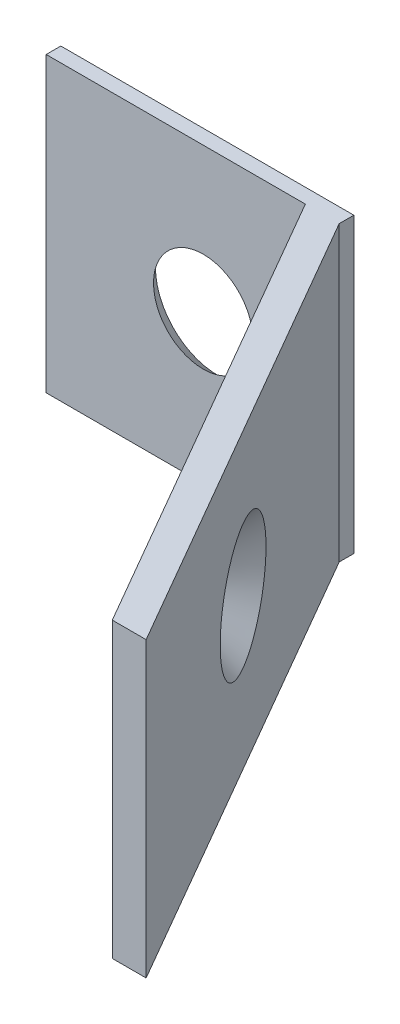
ISO-10303-21;
HEADER;
FILE_DESCRIPTION(('STEP AP214'),'2;1');
FILE_NAME('part.step','',(''),(''),'','','');
FILE_SCHEMA(('AUTOMOTIVE_DESIGN { 1 0 10303 214 1 1 1 1 }'));
ENDSEC;
DATA;
#1=APPLICATION_CONTEXT('core data for automotive mechanical design processes');
#2=APPLICATION_PROTOCOL_DEFINITION('international standard','automotive_design',2000,#1);
#3=PRODUCT_CONTEXT('',#1,'mechanical');
#4=PRODUCT('Part','Part','',(#3));
#5=PRODUCT_RELATED_PRODUCT_CATEGORY('part','',(#4));
#6=PRODUCT_DEFINITION_FORMATION('','',#4);
#7=PRODUCT_DEFINITION_CONTEXT('part definition',#1,'design');
#8=PRODUCT_DEFINITION('design','',#6,#7);
#9=PRODUCT_DEFINITION_SHAPE('','',#8);
#10=(LENGTH_UNIT() NAMED_UNIT(*) SI_UNIT(.MILLI.,.METRE.));
#11=(NAMED_UNIT(*) PLANE_ANGLE_UNIT() SI_UNIT($,.RADIAN.));
#12=(NAMED_UNIT(*) SI_UNIT($,.STERADIAN.) SOLID_ANGLE_UNIT());
#13=UNCERTAINTY_MEASURE_WITH_UNIT(LENGTH_MEASURE(1.E-05),#10,'distance_accuracy_value','');
#14=(GEOMETRIC_REPRESENTATION_CONTEXT(3) GLOBAL_UNCERTAINTY_ASSIGNED_CONTEXT((#13)) GLOBAL_UNIT_ASSIGNED_CONTEXT((#10,
#11,#12)) REPRESENTATION_CONTEXT('',''));
#15=CARTESIAN_POINT('',(0.,0.,0.));
#16=DIRECTION('',(0.,0.,1.));
#17=DIRECTION('',(1.,0.,0.));
#18=AXIS2_PLACEMENT_3D('',#15,#16,#17);
#19=CARTESIAN_POINT('',(0.,0.,0.5));
#20=DIRECTION('',(1.,0.,0.));
#21=DIRECTION('',(0.,1.,0.));
#22=AXIS2_PLACEMENT_3D('',#19,#20,#21);
#23=PLANE('',#22);
#24=DIRECTION('',(0.,-1.,0.));
#25=VECTOR('',#24,1.);
#26=CARTESIAN_POINT('',(0.,0.,0.));
#27=LINE('',#26,#25);
#28=CARTESIAN_POINT('',(0.,0.,0.));
#29=VERTEX_POINT('',#28);
#30=CARTESIAN_POINT('',(0.,-10.,0.));
#31=VERTEX_POINT('',#30);
#32=EDGE_CURVE('E151',#29,#31,#27,.T.);
#33=ORIENTED_EDGE('',*,*,#32,.T.);
#34=DIRECTION('',(0.,0.,-1.));
#35=VECTOR('',#34,1.);
#36=CARTESIAN_POINT('',(0.,-10.,0.5));
#37=LINE('',#36,#35);
#38=CARTESIAN_POINT('',(0.,-10.,0.5));
#39=VERTEX_POINT('',#38);
#40=EDGE_CURVE('E11',#39,#31,#37,.T.);
#41=ORIENTED_EDGE('',*,*,#40,.F.);
#42=DIRECTION('',(0.,-1.,0.));
#43=VECTOR('',#42,1.);
#44=CARTESIAN_POINT('',(0.,0.,0.5));
#45=LINE('',#44,#43);
#46=CARTESIAN_POINT('',(0.,0.,0.5));
#47=VERTEX_POINT('',#46);
#48=EDGE_CURVE('E154',#47,#39,#45,.T.);
#49=ORIENTED_EDGE('',*,*,#48,.F.);
#50=DIRECTION('',(0.,0.,-1.));
#51=VECTOR('',#50,1.);
#52=CARTESIAN_POINT('',(0.,0.,0.5));
#53=LINE('',#52,#51);
#54=EDGE_CURVE('E163',#47,#29,#53,.T.);
#55=ORIENTED_EDGE('',*,*,#54,.T.);
#56=EDGE_LOOP('',(#33,#41,#49,#55));
#57=FACE_BOUND('',#56,.T.);
#58=ADVANCED_FACE('F42',(#57),#23,.F.);
#59=CARTESIAN_POINT('',(0.,-10.,0.5));
#60=DIRECTION('',(0.,1.,0.));
#61=DIRECTION('',(0.,0.,1.));
#62=AXIS2_PLACEMENT_3D('',#59,#60,#61);
#63=PLANE('',#62);
#64=DIRECTION('',(1.,0.,0.));
#65=VECTOR('',#64,1.);
#66=CARTESIAN_POINT('',(0.,-10.,0.));
#67=LINE('',#66,#65);
#68=CARTESIAN_POINT('',(10.,-10.,0.));
#69=VERTEX_POINT('',#68);
#70=EDGE_CURVE('E167',#31,#69,#67,.T.);
#71=ORIENTED_EDGE('',*,*,#70,.T.);
#72=DIRECTION('',(0.,0.,-1.));
#73=VECTOR('',#72,1.);
#74=CARTESIAN_POINT('',(10.,-10.,0.5));
#75=LINE('',#74,#73);
#76=CARTESIAN_POINT('',(10.,-10.,0.5));
#77=VERTEX_POINT('',#76);
#78=EDGE_CURVE('E50',#77,#69,#75,.T.);
#79=ORIENTED_EDGE('',*,*,#78,.F.);
#80=DIRECTION('',(0.499999999999998,0.,0.86602540378444));
#81=VECTOR('',#80,1.);
#82=CARTESIAN_POINT('',(19.,-10.,16.0884572681199));
#83=LINE('',#82,#81);
#84=CARTESIAN_POINT('',(19.,-10.,16.0884572681199));
#85=VERTEX_POINT('',#84);
#86=EDGE_CURVE('E144',#77,#85,#83,.T.);
#87=ORIENTED_EDGE('',*,*,#86,.T.);
#88=DIRECTION('',(-1.,0.,0.));
#89=VECTOR('',#88,1.);
#90=CARTESIAN_POINT('',(17.8452994616207,-10.,16.0884572681199));
#91=LINE('',#90,#89);
#92=CARTESIAN_POINT('',(17.8452994616207,-10.,16.0884572681199));
#93=VERTEX_POINT('',#92);
#94=EDGE_CURVE('E114',#85,#93,#91,.T.);
#95=ORIENTED_EDGE('',*,*,#94,.T.);
#96=DIRECTION('',(-0.499999999999998,0.,-0.86602540378444));
#97=VECTOR('',#96,1.);
#98=CARTESIAN_POINT('',(8.84529946162075,-10.,0.5));
#99=LINE('',#98,#97);
#100=CARTESIAN_POINT('',(8.84529946162075,-10.,0.5));
#101=VERTEX_POINT('',#100);
#102=EDGE_CURVE('E134',#93,#101,#99,.T.);
#103=ORIENTED_EDGE('',*,*,#102,.T.);
#104=DIRECTION('',(1.,0.,0.));
#105=VECTOR('',#104,1.);
#106=CARTESIAN_POINT('',(0.,-10.,0.5));
#107=LINE('',#106,#105);
#108=EDGE_CURVE('E90',#39,#101,#107,.T.);
#109=ORIENTED_EDGE('',*,*,#108,.F.);
#110=ORIENTED_EDGE('',*,*,#40,.T.);
#111=EDGE_LOOP('',(#71,#79,#87,#95,#103,#109,#110));
#112=FACE_BOUND('',#111,.T.);
#113=ADVANCED_FACE('F193',(#112),#63,.F.);
#114=CARTESIAN_POINT('',(10.,0.,0.5));
#115=DIRECTION('',(-1.,0.,0.));
#116=DIRECTION('',(0.,-1.,0.));
#117=AXIS2_PLACEMENT_3D('',#114,#115,#116);
#118=PLANE('',#117);
#119=DIRECTION('',(0.,1.,0.));
#120=VECTOR('',#119,1.);
#121=CARTESIAN_POINT('',(10.,0.,0.));
#122=LINE('',#121,#120);
#123=CARTESIAN_POINT('',(10.,0.,0.));
#124=VERTEX_POINT('',#123);
#125=EDGE_CURVE('E170',#69,#124,#122,.T.);
#126=ORIENTED_EDGE('',*,*,#125,.T.);
#127=DIRECTION('',(0.,0.,-1.));
#128=VECTOR('',#127,1.);
#129=CARTESIAN_POINT('',(10.,0.,0.5));
#130=LINE('',#129,#128);
#131=CARTESIAN_POINT('',(10.,0.,0.5));
#132=VERTEX_POINT('',#131);
#133=EDGE_CURVE('E177',#132,#124,#130,.T.);
#134=ORIENTED_EDGE('',*,*,#133,.F.);
#135=DIRECTION('',(0.,1.,0.));
#136=VECTOR('',#135,1.);
#137=CARTESIAN_POINT('',(10.,0.,0.5));
#138=LINE('',#137,#136);
#139=EDGE_CURVE('E132',#77,#132,#138,.T.);
#140=ORIENTED_EDGE('',*,*,#139,.F.);
#141=ORIENTED_EDGE('',*,*,#78,.T.);
#142=EDGE_LOOP('',(#126,#134,#140,#141));
#143=FACE_BOUND('',#142,.T.);
#144=ADVANCED_FACE('F183',(#143),#118,.F.);
#145=CARTESIAN_POINT('',(0.,0.,0.5));
#146=DIRECTION('',(0.,-1.,0.));
#147=DIRECTION('',(0.,0.,-1.));
#148=AXIS2_PLACEMENT_3D('',#145,#146,#147);
#149=PLANE('',#148);
#150=DIRECTION('',(-1.,0.,0.));
#151=VECTOR('',#150,1.);
#152=CARTESIAN_POINT('',(0.,0.,0.));
#153=LINE('',#152,#151);
#154=EDGE_CURVE('E84',#124,#29,#153,.T.);
#155=ORIENTED_EDGE('',*,*,#154,.T.);
#156=ORIENTED_EDGE('',*,*,#54,.F.);
#157=DIRECTION('',(-1.,0.,0.));
#158=VECTOR('',#157,1.);
#159=CARTESIAN_POINT('',(0.,0.,0.5));
#160=LINE('',#159,#158);
#161=CARTESIAN_POINT('',(8.84529946162075,0.,0.5));
#162=VERTEX_POINT('',#161);
#163=EDGE_CURVE('E62',#162,#47,#160,.T.);
#164=ORIENTED_EDGE('',*,*,#163,.F.);
#165=DIRECTION('',(-0.499999999999998,0.,-0.86602540378444));
#166=VECTOR('',#165,1.);
#167=CARTESIAN_POINT('',(8.84529946162075,0.,0.5));
#168=LINE('',#167,#166);
#169=CARTESIAN_POINT('',(17.8452994616207,0.,16.0884572681199));
#170=VERTEX_POINT('',#169);
#171=EDGE_CURVE('E121',#170,#162,#168,.T.);
#172=ORIENTED_EDGE('',*,*,#171,.F.);
#173=DIRECTION('',(-1.,0.,0.));
#174=VECTOR('',#173,1.);
#175=CARTESIAN_POINT('',(17.8452994616207,0.,16.0884572681199));
#176=LINE('',#175,#174);
#177=CARTESIAN_POINT('',(19.,0.,16.0884572681199));
#178=VERTEX_POINT('',#177);
#179=EDGE_CURVE('E111',#178,#170,#176,.T.);
#180=ORIENTED_EDGE('',*,*,#179,.F.);
#181=DIRECTION('',(0.499999999999998,0.,0.86602540378444));
#182=VECTOR('',#181,1.);
#183=CARTESIAN_POINT('',(19.,0.,16.0884572681199));
#184=LINE('',#183,#182);
#185=EDGE_CURVE('E125',#132,#178,#184,.T.);
#186=ORIENTED_EDGE('',*,*,#185,.F.);
#187=ORIENTED_EDGE('',*,*,#133,.T.);
#188=EDGE_LOOP('',(#155,#156,#164,#172,#180,#186,#187));
#189=FACE_BOUND('',#188,.T.);
#190=ADVANCED_FACE('F124',(#189),#149,.F.);
#191=CARTESIAN_POINT('',(0.,0.,0.5));
#192=DIRECTION('',(0.,0.,1.));
#193=DIRECTION('',(1.,0.,0.));
#194=AXIS2_PLACEMENT_3D('',#191,#192,#193);
#195=PLANE('',#194);
#196=CARTESIAN_POINT('',(5.3625164013596,-4.92129239402616,0.5));
#197=DIRECTION('',(0.,0.,1.));
#198=DIRECTION('',(1.,0.,0.));
#199=AXIS2_PLACEMENT_3D('',#196,#197,#198);
#200=CIRCLE('',#199,1.69895663109189);
#201=CARTESIAN_POINT('',(7.06147303245148,-4.92129239402616,0.5));
#202=VERTEX_POINT('',#201);
#203=EDGE_CURVE('E139',#202,#202,#200,.T.);
#204=ORIENTED_EDGE('',*,*,#203,.F.);
#205=EDGE_LOOP('',(#204));
#206=FACE_BOUND('',#205,.T.);
#207=DIRECTION('',(0.,-1.,0.));
#208=VECTOR('',#207,1.);
#209=CARTESIAN_POINT('',(8.84529946162075,0.,0.5));
#210=LINE('',#209,#208);
#211=EDGE_CURVE('E57',#162,#101,#210,.T.);
#212=ORIENTED_EDGE('',*,*,#211,.F.);
#213=ORIENTED_EDGE('',*,*,#163,.T.);
#214=ORIENTED_EDGE('',*,*,#48,.T.);
#215=ORIENTED_EDGE('',*,*,#108,.T.);
#216=EDGE_LOOP('',(#212,#213,#214,#215));
#217=FACE_BOUND('',#216,.T.);
#218=ADVANCED_FACE('F203',(#206,#217),#195,.T.);
#219=CARTESIAN_POINT('',(0.,0.,0.));
#220=DIRECTION('',(0.,0.,1.));
#221=DIRECTION('',(1.,0.,0.));
#222=AXIS2_PLACEMENT_3D('',#219,#220,#221);
#223=PLANE('',#222);
#224=CARTESIAN_POINT('',(5.3625164013596,-4.92129239402616,0.));
#225=DIRECTION('',(0.,0.,-1.));
#226=DIRECTION('',(-1.,0.,0.));
#227=AXIS2_PLACEMENT_3D('',#224,#225,#226);
#228=CIRCLE('',#227,2.1336);
#229=CARTESIAN_POINT('',(3.2289164013596,-4.92129239402616,0.));
#230=VERTEX_POINT('',#229);
#231=EDGE_CURVE('E237',#230,#230,#228,.T.);
#232=ORIENTED_EDGE('',*,*,#231,.F.);
#233=EDGE_LOOP('',(#232));
#234=FACE_BOUND('',#233,.T.);
#235=ORIENTED_EDGE('',*,*,#32,.F.);
#236=ORIENTED_EDGE('',*,*,#154,.F.);
#237=ORIENTED_EDGE('',*,*,#125,.F.);
#238=ORIENTED_EDGE('',*,*,#70,.F.);
#239=EDGE_LOOP('',(#235,#236,#237,#238));
#240=FACE_BOUND('',#239,.T.);
#241=ADVANCED_FACE('F186',(#234,#240),#223,.F.);
#242=CARTESIAN_POINT('',(8.84529946162075,0.,0.5));
#243=DIRECTION('',(-0.86602540378444,0.,0.499999999999998));
#244=DIRECTION('',(0.499999999999998,0.,0.86602540378444));
#245=AXIS2_PLACEMENT_3D('',#242,#243,#244);
#246=PLANE('',#245);
#247=CARTESIAN_POINT('',(13.6132022002829,-4.87940747069672,8.75824978890969));
#248=DIRECTION('',(-0.86602540378444,0.,0.499999999999998));
#249=DIRECTION('',(0.499999999999998,0.,0.86602540378444));
#250=AXIS2_PLACEMENT_3D('',#247,#248,#249);
#251=CIRCLE('',#250,1.26431326218375);
#252=CARTESIAN_POINT('',(14.2453588313748,-4.87940747069672,9.85317719230239));
#253=VERTEX_POINT('',#252);
#254=EDGE_CURVE('E230',#253,#253,#251,.T.);
#255=ORIENTED_EDGE('',*,*,#254,.F.);
#256=EDGE_LOOP('',(#255));
#257=FACE_BOUND('',#256,.T.);
#258=ORIENTED_EDGE('',*,*,#102,.F.);
#259=DIRECTION('',(0.,-1.,0.));
#260=VECTOR('',#259,1.);
#261=CARTESIAN_POINT('',(17.8452994616207,0.,16.0884572681199));
#262=LINE('',#261,#260);
#263=EDGE_CURVE('E120',#170,#93,#262,.T.);
#264=ORIENTED_EDGE('',*,*,#263,.F.);
#265=ORIENTED_EDGE('',*,*,#171,.T.);
#266=ORIENTED_EDGE('',*,*,#211,.T.);
#267=EDGE_LOOP('',(#258,#264,#265,#266));
#268=FACE_BOUND('',#267,.T.);
#269=ADVANCED_FACE('F192',(#257,#268),#246,.T.);
#270=CARTESIAN_POINT('',(17.8452994616207,0.,16.0884572681199));
#271=DIRECTION('',(0.,0.,1.));
#272=DIRECTION('',(1.,0.,0.));
#273=AXIS2_PLACEMENT_3D('',#270,#271,#272);
#274=PLANE('',#273);
#275=ORIENTED_EDGE('',*,*,#94,.F.);
#276=DIRECTION('',(0.,-1.,0.));
#277=VECTOR('',#276,1.);
#278=CARTESIAN_POINT('',(19.,0.,16.0884572681199));
#279=LINE('',#278,#277);
#280=EDGE_CURVE('E108',#178,#85,#279,.T.);
#281=ORIENTED_EDGE('',*,*,#280,.F.);
#282=ORIENTED_EDGE('',*,*,#179,.T.);
#283=ORIENTED_EDGE('',*,*,#263,.T.);
#284=EDGE_LOOP('',(#275,#281,#282,#283));
#285=FACE_BOUND('',#284,.T.);
#286=ADVANCED_FACE('F110',(#285),#274,.T.);
#287=CARTESIAN_POINT('',(19.,0.,16.0884572681199));
#288=DIRECTION('',(0.86602540378444,0.,-0.499999999999997));
#289=DIRECTION('',(-0.499999999999998,0.,-0.86602540378444));
#290=AXIS2_PLACEMENT_3D('',#287,#288,#289);
#291=PLANE('',#290);
#292=CARTESIAN_POINT('',(14.4792276040674,-4.87940747069672,8.25824978890968));
#293=DIRECTION('',(0.86602540378444,0.,-0.499999999999998));
#294=DIRECTION('',(-0.499999999999998,0.,-0.86602540378444));
#295=AXIS2_PLACEMENT_3D('',#292,#293,#294);
#296=CIRCLE('',#295,2.1336);
#297=CARTESIAN_POINT('',(13.4124276040674,-4.87940747069672,6.4104979873952));
#298=VERTEX_POINT('',#297);
#299=EDGE_CURVE('E233',#298,#298,#296,.T.);
#300=ORIENTED_EDGE('',*,*,#299,.F.);
#301=EDGE_LOOP('',(#300));
#302=FACE_BOUND('',#301,.T.);
#303=ORIENTED_EDGE('',*,*,#86,.F.);
#304=ORIENTED_EDGE('',*,*,#139,.T.);
#305=ORIENTED_EDGE('',*,*,#185,.T.);
#306=ORIENTED_EDGE('',*,*,#280,.T.);
#307=EDGE_LOOP('',(#303,#304,#305,#306));
#308=FACE_BOUND('',#307,.T.);
#309=ADVANCED_FACE('F130',(#302,#308),#291,.T.);
#310=CARTESIAN_POINT('',(5.3625164013596,-4.92129239402616,0.));
#311=DIRECTION('',(0.,0.,-1.));
#312=DIRECTION('',(-1.,0.,0.));
#313=AXIS2_PLACEMENT_3D('',#310,#311,#312);
#314=CONICAL_SURFACE('',#313,2.1336,0.715584993317674);
#315=ORIENTED_EDGE('',*,*,#203,.T.);
#316=EDGE_LOOP('',(#315));
#317=FACE_BOUND('',#316,.T.);
#318=ORIENTED_EDGE('',*,*,#231,.T.);
#319=EDGE_LOOP('',(#318));
#320=FACE_BOUND('',#319,.T.);
#321=ADVANCED_FACE('F212',(#317,#320),#314,.F.);
#322=CARTESIAN_POINT('',(14.4792276040674,-4.87940747069672,8.25824978890968));
#323=DIRECTION('',(0.86602540378444,0.,-0.499999999999998));
#324=DIRECTION('',(-0.499999999999998,0.,-0.86602540378444));
#325=AXIS2_PLACEMENT_3D('',#322,#323,#324);
#326=CONICAL_SURFACE('',#325,2.1336,0.71558499331768);
#327=ORIENTED_EDGE('',*,*,#254,.T.);
#328=EDGE_LOOP('',(#327));
#329=FACE_BOUND('',#328,.T.);
#330=ORIENTED_EDGE('',*,*,#299,.T.);
#331=EDGE_LOOP('',(#330));
#332=FACE_BOUND('',#331,.T.);
#333=ADVANCED_FACE('F221',(#329,#332),#326,.F.);
#334=CLOSED_SHELL('',(#58,#113,#144,#190,#218,#241,#269,#286,#309,#321,#333));
#335=MANIFOLD_SOLID_BREP('B2',#334);
#336=ADVANCED_BREP_SHAPE_REPRESENTATION('',(#18,#335),#14);
#337=SHAPE_DEFINITION_REPRESENTATION(#9,#336);
ENDSEC;
END-ISO-10303-21;
